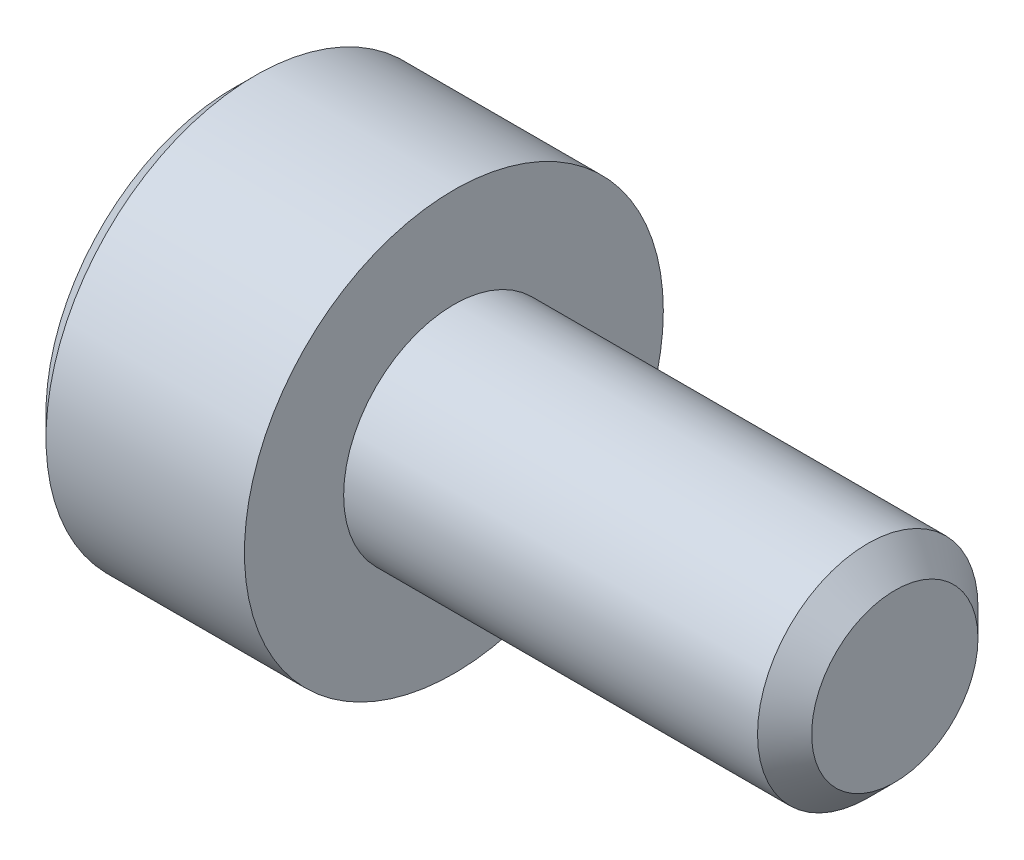
ISO-10303-21;
HEADER;
FILE_DESCRIPTION(('STEP AP214'),'2;1');
FILE_NAME('part.step','',(''),(''),'','','');
FILE_SCHEMA(('AUTOMOTIVE_DESIGN { 1 0 10303 214 1 1 1 1 }'));
ENDSEC;
DATA;
#1=APPLICATION_CONTEXT('core data for automotive mechanical design processes');
#2=APPLICATION_PROTOCOL_DEFINITION('international standard','automotive_design',2000,#1);
#3=PRODUCT_CONTEXT('',#1,'mechanical');
#4=PRODUCT('Part','Part','',(#3));
#5=PRODUCT_RELATED_PRODUCT_CATEGORY('part','',(#4));
#6=PRODUCT_DEFINITION_FORMATION('','',#4);
#7=PRODUCT_DEFINITION_CONTEXT('part definition',#1,'design');
#8=PRODUCT_DEFINITION('design','',#6,#7);
#9=PRODUCT_DEFINITION_SHAPE('','',#8);
#10=(LENGTH_UNIT() NAMED_UNIT(*) SI_UNIT(.MILLI.,.METRE.));
#11=(NAMED_UNIT(*) PLANE_ANGLE_UNIT() SI_UNIT($,.RADIAN.));
#12=(NAMED_UNIT(*) SI_UNIT($,.STERADIAN.) SOLID_ANGLE_UNIT());
#13=UNCERTAINTY_MEASURE_WITH_UNIT(LENGTH_MEASURE(1.E-05),#10,'distance_accuracy_value','');
#14=(GEOMETRIC_REPRESENTATION_CONTEXT(3) GLOBAL_UNCERTAINTY_ASSIGNED_CONTEXT((#13)) GLOBAL_UNIT_ASSIGNED_CONTEXT((#10,
#11,#12)) REPRESENTATION_CONTEXT('',''));
#15=CARTESIAN_POINT('',(0.,0.,0.));
#16=DIRECTION('',(0.,0.,1.));
#17=DIRECTION('',(1.,0.,0.));
#18=AXIS2_PLACEMENT_3D('',#15,#16,#17);
#19=CARTESIAN_POINT('',(-1.1,0.,0.));
#20=DIRECTION('',(1.,0.,0.));
#21=DIRECTION('',(0.,0.,-1.));
#22=AXIS2_PLACEMENT_3D('',#19,#20,#21);
#23=PLANE('',#22);
#24=CARTESIAN_POINT('',(-1.1,0.,0.));
#25=DIRECTION('',(-1.,0.,0.));
#26=DIRECTION('',(0.,-0.866025403784439,-0.5));
#27=AXIS2_PLACEMENT_3D('',#24,#25,#26);
#28=CIRCLE('',#27,0.75);
#29=CARTESIAN_POINT('',(-1.1,-0.649519052838329,-0.375));
#30=VERTEX_POINT('',#29);
#31=CARTESIAN_POINT('',(-1.1,-0.649519052838329,0.375));
#32=VERTEX_POINT('',#31);
#33=EDGE_CURVE('E113',#30,#32,#28,.T.);
#34=ORIENTED_EDGE('',*,*,#33,.F.);
#35=DIRECTION('',(0.,0.5,-0.866025403784438));
#36=VECTOR('',#35,1.);
#37=CARTESIAN_POINT('',(-1.1,-0.86602540378444,0.));
#38=LINE('',#37,#36);
#39=CARTESIAN_POINT('',(-1.1,-0.86602540378444,0.));
#40=VERTEX_POINT('',#39);
#41=EDGE_CURVE('E123',#40,#30,#38,.T.);
#42=ORIENTED_EDGE('',*,*,#41,.F.);
#43=DIRECTION('',(0.,-0.5,-0.866025403784438));
#44=VECTOR('',#43,1.);
#45=CARTESIAN_POINT('',(-1.1,-0.64951905283833,0.375));
#46=LINE('',#45,#44);
#47=EDGE_CURVE('E124',#32,#40,#46,.T.);
#48=ORIENTED_EDGE('',*,*,#47,.F.);
#49=EDGE_LOOP('',(#34,#42,#48));
#50=FACE_BOUND('',#49,.T.);
#51=ADVANCED_FACE('F17',(#50),#23,.F.);
#52=CARTESIAN_POINT('',(-1.1,0.,0.));
#53=DIRECTION('',(-1.,0.,0.));
#54=DIRECTION('',(0.,0.,1.));
#55=AXIS2_PLACEMENT_3D('',#52,#53,#54);
#56=CONICAL_SURFACE('',#55,0.75,1.0471975511966);
#57=CARTESIAN_POINT('',(-0.66698729810778,0.,0.));
#58=VERTEX_POINT('',#57);
#59=VERTEX_LOOP('',#58);
#60=FACE_BOUND('',#59,.T.);
#61=CARTESIAN_POINT('',(-1.1,0.,0.));
#62=DIRECTION('',(-1.,0.,0.));
#63=DIRECTION('',(0.,0.,1.));
#64=AXIS2_PLACEMENT_3D('',#61,#62,#63);
#65=CIRCLE('',#64,0.75);
#66=CARTESIAN_POINT('',(-1.1,0.,0.75));
#67=VERTEX_POINT('',#66);
#68=CARTESIAN_POINT('',(-1.1,0.649519052838329,0.375));
#69=VERTEX_POINT('',#68);
#70=EDGE_CURVE('E135',#67,#69,#65,.T.);
#71=ORIENTED_EDGE('',*,*,#70,.T.);
#72=CARTESIAN_POINT('',(-1.1,0.,0.));
#73=DIRECTION('',(-1.,0.,0.));
#74=DIRECTION('',(0.,0.866025403784438,0.5));
#75=AXIS2_PLACEMENT_3D('',#72,#73,#74);
#76=CIRCLE('',#75,0.75);
#77=CARTESIAN_POINT('',(-1.1,0.64951905283833,-0.375));
#78=VERTEX_POINT('',#77);
#79=EDGE_CURVE('E146',#69,#78,#76,.T.);
#80=ORIENTED_EDGE('',*,*,#79,.T.);
#81=CARTESIAN_POINT('',(-1.1,0.,0.));
#82=DIRECTION('',(-1.,0.,0.));
#83=DIRECTION('',(0.,0.866025403784439,-0.499999999999999));
#84=AXIS2_PLACEMENT_3D('',#81,#82,#83);
#85=CIRCLE('',#84,0.75);
#86=CARTESIAN_POINT('',(-1.1,0.,-0.75));
#87=VERTEX_POINT('',#86);
#88=EDGE_CURVE('E116',#78,#87,#85,.T.);
#89=ORIENTED_EDGE('',*,*,#88,.T.);
#90=CARTESIAN_POINT('',(-1.1,0.,0.));
#91=DIRECTION('',(-1.,0.,0.));
#92=DIRECTION('',(0.,0.,-1.));
#93=AXIS2_PLACEMENT_3D('',#90,#91,#92);
#94=CIRCLE('',#93,0.75);
#95=EDGE_CURVE('E97',#87,#30,#94,.T.);
#96=ORIENTED_EDGE('',*,*,#95,.T.);
#97=ORIENTED_EDGE('',*,*,#33,.T.);
#98=CARTESIAN_POINT('',(-1.1,0.,0.));
#99=DIRECTION('',(-1.,0.,0.));
#100=DIRECTION('',(0.,-0.866025403784439,0.5));
#101=AXIS2_PLACEMENT_3D('',#98,#99,#100);
#102=CIRCLE('',#101,0.75);
#103=EDGE_CURVE('E118',#32,#67,#102,.T.);
#104=ORIENTED_EDGE('',*,*,#103,.T.);
#105=EDGE_LOOP('',(#71,#80,#89,#96,#97,#104));
#106=FACE_BOUND('',#105,.T.);
#107=ADVANCED_FACE('F111',(#60,#106),#56,.F.);
#108=CARTESIAN_POINT('',(-1.1,-0.86602540378444,0.));
#109=DIRECTION('',(0.,0.866025403784439,0.5));
#110=DIRECTION('',(0.,-0.5,0.866025403784439));
#111=AXIS2_PLACEMENT_3D('',#108,#109,#110);
#112=PLANE('',#111);
#113=CARTESIAN_POINT('',(-1.9999999999179,-0.433012701974319,-0.749999999857802));
#114=CARTESIAN_POINT('',(-1.9401838107394,-0.49282889116983,-0.646395321056023));
#115=CARTESIAN_POINT('',(-1.8956946022904,-0.554952880204504,-0.538793415679117));
#116=CARTESIAN_POINT('',(-1.87906646576922,-0.669846193101474,-0.339792360291656));
#117=CARTESIAN_POINT('',(-1.89074693706411,-0.716350750813577,-0.259244103550774));
#118=CARTESIAN_POINT('',(-1.9377314223987,-0.798089755438794,-0.117667994579791));
#119=CARTESIAN_POINT('',(-1.96650341766561,-0.832528821447527,-0.0580177824874472));
#120=CARTESIAN_POINT('',(-1.99999999997828,-0.866025403762719,-3.76224996805638E-11));
#121=B_SPLINE_CURVE_WITH_KNOTS('',3,(#113,#114,#115,#116,#117,#118,#119,#120),.UNSPECIFIED.,.F.,
.F.,(4,2,2,4),(0.000254442834198881,0.395658519929771,0.67469393768709,0.894818657925145),.UNSPECIFIED.);
#122=CARTESIAN_POINT('',(-2.,-0.43301270189222,-0.75));
#123=VERTEX_POINT('',#122);
#124=CARTESIAN_POINT('',(-2.,-0.86602540378444,0.));
#125=VERTEX_POINT('',#124);
#126=EDGE_CURVE('E161',#123,#125,#121,.T.);
#127=ORIENTED_EDGE('',*,*,#126,.T.);
#128=DIRECTION('',(-1.,0.,0.));
#129=VECTOR('',#128,1.);
#130=CARTESIAN_POINT('',(-1.1,-0.86602540378444,0.));
#131=LINE('',#130,#129);
#132=EDGE_CURVE('E104',#40,#125,#131,.T.);
#133=ORIENTED_EDGE('',*,*,#132,.F.);
#134=ORIENTED_EDGE('',*,*,#41,.T.);
#135=DIRECTION('',(0.,0.5,-0.866025403784438));
#136=VECTOR('',#135,1.);
#137=CARTESIAN_POINT('',(-1.1,-0.64951905283833,-0.375000000000001));
#138=LINE('',#137,#136);
#139=CARTESIAN_POINT('',(-1.1,-0.43301270189222,-0.75));
#140=VERTEX_POINT('',#139);
#141=EDGE_CURVE('E94',#30,#140,#138,.T.);
#142=ORIENTED_EDGE('',*,*,#141,.T.);
#143=DIRECTION('',(-1.,0.,0.));
#144=VECTOR('',#143,1.);
#145=CARTESIAN_POINT('',(-1.1,-0.43301270189222,-0.75));
#146=LINE('',#145,#144);
#147=EDGE_CURVE('E103',#140,#123,#146,.T.);
#148=ORIENTED_EDGE('',*,*,#147,.T.);
#149=EDGE_LOOP('',(#127,#133,#134,#142,#148));
#150=FACE_BOUND('',#149,.T.);
#151=ADVANCED_FACE('F129',(#150),#112,.T.);
#152=CARTESIAN_POINT('',(-1.1,-0.43301270189222,0.75));
#153=DIRECTION('',(0.,0.866025403784439,-0.5));
#154=DIRECTION('',(0.,0.5,0.866025403784439));
#155=AXIS2_PLACEMENT_3D('',#152,#153,#154);
#156=PLANE('',#155);
#157=CARTESIAN_POINT('',(-1.9999999999179,-0.866025403702341,1.42198644352554E-10));
#158=CARTESIAN_POINT('',(-1.9401838107394,-0.806209214506829,0.103604678943978));
#159=CARTESIAN_POINT('',(-1.89569460229039,-0.744085225472155,0.211206584320885));
#160=CARTESIAN_POINT('',(-1.87906646576922,-0.629191912575185,0.410207639708346));
#161=CARTESIAN_POINT('',(-1.89074693706411,-0.582687354863082,0.490755896449228));
#162=CARTESIAN_POINT('',(-1.9377314223987,-0.500948350237865,0.63233200542021));
#163=CARTESIAN_POINT('',(-1.96650341766561,-0.466509284229132,0.691982217512554));
#164=CARTESIAN_POINT('',(-1.99999999997828,-0.433012701913941,0.749999999962378));
#165=B_SPLINE_CURVE_WITH_KNOTS('',3,(#157,#158,#159,#160,#161,#162,#163,#164),.UNSPECIFIED.,.F.,
.F.,(4,2,2,4),(0.000254442834198843,0.395658519929773,0.674693937687092,0.894818657925144),.UNSPECIFIED.);
#166=CARTESIAN_POINT('',(-2.,-0.43301270189222,0.75));
#167=VERTEX_POINT('',#166);
#168=EDGE_CURVE('E207',#125,#167,#165,.T.);
#169=ORIENTED_EDGE('',*,*,#168,.T.);
#170=DIRECTION('',(-1.,0.,0.));
#171=VECTOR('',#170,1.);
#172=CARTESIAN_POINT('',(-1.1,-0.43301270189222,0.75));
#173=LINE('',#172,#171);
#174=CARTESIAN_POINT('',(-1.1,-0.43301270189222,0.75));
#175=VERTEX_POINT('',#174);
#176=EDGE_CURVE('E197',#175,#167,#173,.T.);
#177=ORIENTED_EDGE('',*,*,#176,.F.);
#178=DIRECTION('',(0.,-0.5,-0.866025403784438));
#179=VECTOR('',#178,1.);
#180=CARTESIAN_POINT('',(-1.1,-0.43301270189222,0.75));
#181=LINE('',#180,#179);
#182=EDGE_CURVE('E206',#175,#32,#181,.T.);
#183=ORIENTED_EDGE('',*,*,#182,.T.);
#184=ORIENTED_EDGE('',*,*,#47,.T.);
#185=ORIENTED_EDGE('',*,*,#132,.T.);
#186=EDGE_LOOP('',(#169,#177,#183,#184,#185));
#187=FACE_BOUND('',#186,.T.);
#188=ADVANCED_FACE('F180',(#187),#156,.T.);
#189=ORIENTED_EDGE('',*,*,#70,.F.);
#190=DIRECTION('',(0.,-1.,0.));
#191=VECTOR('',#190,1.);
#192=CARTESIAN_POINT('',(-1.1,0.43301270189222,0.75));
#193=LINE('',#192,#191);
#194=CARTESIAN_POINT('',(-1.1,0.43301270189222,0.75));
#195=VERTEX_POINT('',#194);
#196=EDGE_CURVE('E213',#195,#67,#193,.T.);
#197=ORIENTED_EDGE('',*,*,#196,.F.);
#198=DIRECTION('',(0.,-0.5,0.866025403784438));
#199=VECTOR('',#198,1.);
#200=CARTESIAN_POINT('',(-1.1,0.64951905283833,0.375000000000001));
#201=LINE('',#200,#199);
#202=EDGE_CURVE('E218',#69,#195,#201,.T.);
#203=ORIENTED_EDGE('',*,*,#202,.F.);
#204=EDGE_LOOP('',(#189,#197,#203));
#205=FACE_BOUND('',#204,.T.);
#206=ADVANCED_FACE('F185',(#205),#23,.F.);
#207=ORIENTED_EDGE('',*,*,#79,.F.);
#208=DIRECTION('',(0.,-0.5,0.866025403784438));
#209=VECTOR('',#208,1.);
#210=CARTESIAN_POINT('',(-1.1,0.86602540378444,0.));
#211=LINE('',#210,#209);
#212=CARTESIAN_POINT('',(-1.1,0.86602540378444,0.));
#213=VERTEX_POINT('',#212);
#214=EDGE_CURVE('E223',#213,#69,#211,.T.);
#215=ORIENTED_EDGE('',*,*,#214,.F.);
#216=DIRECTION('',(0.,0.5,0.866025403784438));
#217=VECTOR('',#216,1.);
#218=CARTESIAN_POINT('',(-1.1,0.64951905283833,-0.375));
#219=LINE('',#218,#217);
#220=EDGE_CURVE('E228',#78,#213,#219,.T.);
#221=ORIENTED_EDGE('',*,*,#220,.F.);
#222=EDGE_LOOP('',(#207,#215,#221));
#223=FACE_BOUND('',#222,.T.);
#224=ADVANCED_FACE('F396',(#223),#23,.F.);
#225=ORIENTED_EDGE('',*,*,#88,.F.);
#226=DIRECTION('',(0.,0.5,0.866025403784439));
#227=VECTOR('',#226,1.);
#228=CARTESIAN_POINT('',(-1.1,0.43301270189222,-0.75));
#229=LINE('',#228,#227);
#230=CARTESIAN_POINT('',(-1.1,0.43301270189222,-0.75));
#231=VERTEX_POINT('',#230);
#232=EDGE_CURVE('E233',#231,#78,#229,.T.);
#233=ORIENTED_EDGE('',*,*,#232,.F.);
#234=DIRECTION('',(0.,1.,0.));
#235=VECTOR('',#234,1.);
#236=CARTESIAN_POINT('',(-1.1,0.,-0.75));
#237=LINE('',#236,#235);
#238=EDGE_CURVE('E238',#87,#231,#237,.T.);
#239=ORIENTED_EDGE('',*,*,#238,.F.);
#240=EDGE_LOOP('',(#225,#233,#239));
#241=FACE_BOUND('',#240,.T.);
#242=ADVANCED_FACE('F401',(#241),#23,.F.);
#243=ORIENTED_EDGE('',*,*,#95,.F.);
#244=DIRECTION('',(0.,1.,0.));
#245=VECTOR('',#244,1.);
#246=CARTESIAN_POINT('',(-1.1,-0.43301270189222,-0.75));
#247=LINE('',#246,#245);
#248=EDGE_CURVE('E98',#140,#87,#247,.T.);
#249=ORIENTED_EDGE('',*,*,#248,.F.);
#250=ORIENTED_EDGE('',*,*,#141,.F.);
#251=EDGE_LOOP('',(#243,#249,#250));
#252=FACE_BOUND('',#251,.T.);
#253=ADVANCED_FACE('F96',(#252),#23,.F.);
#254=ORIENTED_EDGE('',*,*,#103,.F.);
#255=ORIENTED_EDGE('',*,*,#182,.F.);
#256=DIRECTION('',(0.,-1.,0.));
#257=VECTOR('',#256,1.);
#258=CARTESIAN_POINT('',(-1.1,0.,0.75));
#259=LINE('',#258,#257);
#260=EDGE_CURVE('E248',#67,#175,#259,.T.);
#261=ORIENTED_EDGE('',*,*,#260,.F.);
#262=EDGE_LOOP('',(#254,#255,#261));
#263=FACE_BOUND('',#262,.T.);
#264=ADVANCED_FACE('F388',(#263),#23,.F.);
#265=CARTESIAN_POINT('',(-1.1339745962156,0.,0.));
#266=DIRECTION('',(-1.,0.,0.));
#267=DIRECTION('',(0.,0.,1.));
#268=AXIS2_PLACEMENT_3D('',#265,#266,#267);
#269=CONICAL_SURFACE('',#268,0.,0.785398163397472);
#270=ORIENTED_EDGE('',*,*,#126,.F.);
#271=CARTESIAN_POINT('',(-2.,0.,0.));
#272=DIRECTION('',(1.,0.,0.));
#273=DIRECTION('',(0.,-1.,0.));
#274=AXIS2_PLACEMENT_3D('',#271,#272,#273);
#275=CIRCLE('',#274,0.866025403784441);
#276=EDGE_CURVE('E253',#125,#123,#275,.T.);
#277=ORIENTED_EDGE('',*,*,#276,.F.);
#278=EDGE_LOOP('',(#270,#277));
#279=FACE_BOUND('',#278,.T.);
#280=ADVANCED_FACE('F187',(#279),#269,.F.);
#281=CARTESIAN_POINT('',(-1.1,-0.43301270189222,-0.75));
#282=DIRECTION('',(0.,0.,1.));
#283=DIRECTION('',(1.,0.,0.));
#284=AXIS2_PLACEMENT_3D('',#281,#282,#283);
#285=PLANE('',#284);
#286=CARTESIAN_POINT('',(-1.99999788888541,0.433008479647611,-0.75));
#287=CARTESIAN_POINT('',(-1.9634376860963,0.359887539323594,-0.75));
#288=CARTESIAN_POINT('',(-1.9325413183393,0.284716303607357,-0.75));
#289=CARTESIAN_POINT('',(-1.88870118310543,0.118731283464714,-0.75));
#290=CARTESIAN_POINT('',(-1.87925269831782,0.0304904917107161,-0.75));
#291=CARTESIAN_POINT('',(-1.89333255479817,-0.148514984328396,-0.75));
#292=CARTESIAN_POINT('',(-1.91601656828485,-0.234370493285572,-0.75));
#293=CARTESIAN_POINT('',(-1.96374813137855,-0.356858620157467,-0.75));
#294=CARTESIAN_POINT('',(-1.98109886940823,-0.395210421930607,-0.75));
#295=CARTESIAN_POINT('',(-1.99999985660165,-0.433012415095464,-0.75));
#296=B_SPLINE_CURVE_WITH_KNOTS('',3,(#286,#287,#288,#289,#290,#291,#292,#293,#294,#295),
.UNSPECIFIED.,.F.,.F.,(4,2,2,2,4),(1.55652675401323,1.8010941771872,2.06822950654005,
2.33439302759544,2.46112410524446),.UNSPECIFIED.);
#297=CARTESIAN_POINT('',(-2.,0.43301270189222,-0.75));
#298=VERTEX_POINT('',#297);
#299=EDGE_CURVE('E270',#298,#123,#296,.T.);
#300=ORIENTED_EDGE('',*,*,#299,.T.);
#301=ORIENTED_EDGE('',*,*,#147,.F.);
#302=ORIENTED_EDGE('',*,*,#248,.T.);
#303=ORIENTED_EDGE('',*,*,#238,.T.);
#304=DIRECTION('',(-1.,0.,0.));
#305=VECTOR('',#304,1.);
#306=CARTESIAN_POINT('',(-1.1,0.43301270189222,-0.75));
#307=LINE('',#306,#305);
#308=EDGE_CURVE('E281',#231,#298,#307,.T.);
#309=ORIENTED_EDGE('',*,*,#308,.T.);
#310=EDGE_LOOP('',(#300,#301,#302,#303,#309));
#311=FACE_BOUND('',#310,.T.);
#312=ADVANCED_FACE('F283',(#311),#285,.T.);
#313=ORIENTED_EDGE('',*,*,#168,.F.);
#314=CARTESIAN_POINT('',(-2.,0.,0.));
#315=DIRECTION('',(1.,0.,0.));
#316=DIRECTION('',(0.,-0.500000000000001,0.866025403784438));
#317=AXIS2_PLACEMENT_3D('',#314,#315,#316);
#318=CIRCLE('',#317,0.866025403784441);
#319=EDGE_CURVE('E415',#167,#125,#318,.T.);
#320=ORIENTED_EDGE('',*,*,#319,.F.);
#321=EDGE_LOOP('',(#313,#320));
#322=FACE_BOUND('',#321,.T.);
#323=ADVANCED_FACE('F292',(#322),#269,.F.);
#324=CARTESIAN_POINT('',(-1.1,0.43301270189222,0.75));
#325=DIRECTION('',(0.,0.,-1.));
#326=DIRECTION('',(-1.,0.,0.));
#327=AXIS2_PLACEMENT_3D('',#324,#325,#326);
#328=PLANE('',#327);
#329=CARTESIAN_POINT('',(-1.99999788888541,-0.433008479647612,0.75));
#330=CARTESIAN_POINT('',(-1.9634376860963,-0.359887539323595,0.75));
#331=CARTESIAN_POINT('',(-1.9325413183393,-0.284716303607357,0.75));
#332=CARTESIAN_POINT('',(-1.88870118310543,-0.118731283464714,0.75));
#333=CARTESIAN_POINT('',(-1.87925269831782,-0.030490491710716,0.75));
#334=CARTESIAN_POINT('',(-1.89333255479817,0.148514984328397,0.75));
#335=CARTESIAN_POINT('',(-1.91601656828485,0.234370493285572,0.75));
#336=CARTESIAN_POINT('',(-1.96374813137855,0.356858620157467,0.75));
#337=CARTESIAN_POINT('',(-1.98109886940823,0.395210421930606,0.75));
#338=CARTESIAN_POINT('',(-1.99999985660165,0.433012415095462,0.75));
#339=B_SPLINE_CURVE_WITH_KNOTS('',3,(#329,#330,#331,#332,#333,#334,#335,#336,#337,#338),
.UNSPECIFIED.,.F.,.F.,(4,2,2,2,4),(1.55652675401323,1.8010941771872,2.06822950654005,
2.33439302759544,2.46112410524446),.UNSPECIFIED.);
#340=CARTESIAN_POINT('',(-2.,0.43301270189222,0.75));
#341=VERTEX_POINT('',#340);
#342=EDGE_CURVE('E317',#167,#341,#339,.T.);
#343=ORIENTED_EDGE('',*,*,#342,.T.);
#344=DIRECTION('',(-1.,0.,0.));
#345=VECTOR('',#344,1.);
#346=CARTESIAN_POINT('',(-1.1,0.43301270189222,0.75));
#347=LINE('',#346,#345);
#348=EDGE_CURVE('E307',#195,#341,#347,.T.);
#349=ORIENTED_EDGE('',*,*,#348,.F.);
#350=ORIENTED_EDGE('',*,*,#196,.T.);
#351=ORIENTED_EDGE('',*,*,#260,.T.);
#352=ORIENTED_EDGE('',*,*,#176,.T.);
#353=EDGE_LOOP('',(#343,#349,#350,#351,#352));
#354=FACE_BOUND('',#353,.T.);
#355=ADVANCED_FACE('F293',(#354),#328,.T.);
#356=CARTESIAN_POINT('',(-1.1,0.86602540378444,0.));
#357=DIRECTION('',(0.,-0.866025403784439,-0.5));
#358=DIRECTION('',(0.,0.5,-0.866025403784439));
#359=AXIS2_PLACEMENT_3D('',#356,#357,#358);
#360=PLANE('',#359);
#361=CARTESIAN_POINT('',(-1.9999999999179,0.433012701974319,0.749999999857802));
#362=CARTESIAN_POINT('',(-1.9401838107394,0.49282889116983,0.646395321056023));
#363=CARTESIAN_POINT('',(-1.8956946022904,0.554952880204504,0.538793415679117));
#364=CARTESIAN_POINT('',(-1.87906646576922,0.669846193101474,0.339792360291656));
#365=CARTESIAN_POINT('',(-1.89074693706411,0.716350750813578,0.259244103550774));
#366=CARTESIAN_POINT('',(-1.9377314223987,0.798089755438794,0.117667994579791));
#367=CARTESIAN_POINT('',(-1.96650341766561,0.832528821447527,0.0580177824874475));
#368=CARTESIAN_POINT('',(-1.99999999997828,0.866025403762719,3.76229008780925E-11));
#369=B_SPLINE_CURVE_WITH_KNOTS('',3,(#361,#362,#363,#364,#365,#366,#367,#368),.UNSPECIFIED.,.F.,
.F.,(4,2,2,4),(0.000254442834198641,0.395658519929771,0.67469393768709,0.894818657925144),.UNSPECIFIED.);
#370=CARTESIAN_POINT('',(-2.,0.86602540378444,0.));
#371=VERTEX_POINT('',#370);
#372=EDGE_CURVE('E316',#341,#371,#369,.T.);
#373=ORIENTED_EDGE('',*,*,#372,.T.);
#374=DIRECTION('',(-1.,0.,0.));
#375=VECTOR('',#374,1.);
#376=CARTESIAN_POINT('',(-1.1,0.86602540378444,0.));
#377=LINE('',#376,#375);
#378=EDGE_CURVE('E327',#213,#371,#377,.T.);
#379=ORIENTED_EDGE('',*,*,#378,.F.);
#380=ORIENTED_EDGE('',*,*,#214,.T.);
#381=ORIENTED_EDGE('',*,*,#202,.T.);
#382=ORIENTED_EDGE('',*,*,#348,.T.);
#383=EDGE_LOOP('',(#373,#379,#380,#381,#382));
#384=FACE_BOUND('',#383,.T.);
#385=ADVANCED_FACE('F297',(#384),#360,.T.);
#386=CARTESIAN_POINT('',(-1.1,0.43301270189222,-0.75));
#387=DIRECTION('',(0.,-0.866025403784439,0.5));
#388=DIRECTION('',(0.,-0.5,-0.866025403784439));
#389=AXIS2_PLACEMENT_3D('',#386,#387,#388);
#390=PLANE('',#389);
#391=CARTESIAN_POINT('',(-1.9999999999179,0.866025403702341,-1.42198210671685E-10));
#392=CARTESIAN_POINT('',(-1.9401838107394,0.806209214506829,-0.103604678943977));
#393=CARTESIAN_POINT('',(-1.8956946022904,0.744085225472155,-0.211206584320884));
#394=CARTESIAN_POINT('',(-1.87906646576922,0.629191912575185,-0.410207639708346));
#395=CARTESIAN_POINT('',(-1.89074693706411,0.582687354863082,-0.490755896449228));
#396=CARTESIAN_POINT('',(-1.9377314223987,0.500948350237865,-0.63233200542021));
#397=CARTESIAN_POINT('',(-1.96650341766561,0.466509284229132,-0.691982217512554));
#398=CARTESIAN_POINT('',(-1.99999999997828,0.433012701913941,-0.749999999962378));
#399=B_SPLINE_CURVE_WITH_KNOTS('',3,(#391,#392,#393,#394,#395,#396,#397,#398),.UNSPECIFIED.,.F.,
.F.,(4,2,2,4),(0.000254442834198843,0.395658519929773,0.674693937687092,0.894818657925144),.UNSPECIFIED.);
#400=EDGE_CURVE('E335',#371,#298,#399,.T.);
#401=ORIENTED_EDGE('',*,*,#400,.T.);
#402=ORIENTED_EDGE('',*,*,#308,.F.);
#403=ORIENTED_EDGE('',*,*,#232,.T.);
#404=ORIENTED_EDGE('',*,*,#220,.T.);
#405=ORIENTED_EDGE('',*,*,#378,.T.);
#406=EDGE_LOOP('',(#401,#402,#403,#404,#405));
#407=FACE_BOUND('',#406,.T.);
#408=ADVANCED_FACE('F347',(#407),#390,.T.);
#409=CARTESIAN_POINT('',(-2.,0.86602540378444,0.));
#410=DIRECTION('',(1.,0.,0.));
#411=DIRECTION('',(0.,0.,-1.));
#412=AXIS2_PLACEMENT_3D('',#409,#410,#411);
#413=PLANE('',#412);
#414=CARTESIAN_POINT('',(-2.,0.,0.));
#415=DIRECTION('',(1.,0.,0.));
#416=DIRECTION('',(0.,0.,-1.));
#417=AXIS2_PLACEMENT_3D('',#414,#415,#416);
#418=CIRCLE('',#417,1.7);
#419=CARTESIAN_POINT('',(-2.,0.,-1.7));
#420=VERTEX_POINT('',#419);
#421=EDGE_CURVE('E345',#420,#420,#418,.T.);
#422=ORIENTED_EDGE('',*,*,#421,.F.);
#423=EDGE_LOOP('',(#422));
#424=FACE_BOUND('',#423,.T.);
#425=CARTESIAN_POINT('',(-2.,0.,0.));
#426=DIRECTION('',(1.,0.,0.));
#427=DIRECTION('',(0.,0.500000000000001,-0.866025403784438));
#428=AXIS2_PLACEMENT_3D('',#425,#426,#427);
#429=CIRCLE('',#428,0.866025403784441);
#430=EDGE_CURVE('E771',#298,#371,#429,.T.);
#431=ORIENTED_EDGE('',*,*,#430,.T.);
#432=CARTESIAN_POINT('',(-2.,0.,0.));
#433=DIRECTION('',(1.,0.,0.));
#434=DIRECTION('',(0.,1.,0.));
#435=AXIS2_PLACEMENT_3D('',#432,#433,#434);
#436=CIRCLE('',#435,0.866025403784441);
#437=EDGE_CURVE('E32',#371,#341,#436,.T.);
#438=ORIENTED_EDGE('',*,*,#437,.T.);
#439=CARTESIAN_POINT('',(-2.,0.,0.));
#440=DIRECTION('',(1.,0.,0.));
#441=DIRECTION('',(0.,0.5,0.866025403784438));
#442=AXIS2_PLACEMENT_3D('',#439,#440,#441);
#443=CIRCLE('',#442,0.866025403784441);
#444=EDGE_CURVE('E39',#341,#167,#443,.T.);
#445=ORIENTED_EDGE('',*,*,#444,.T.);
#446=ORIENTED_EDGE('',*,*,#319,.T.);
#447=ORIENTED_EDGE('',*,*,#276,.T.);
#448=CARTESIAN_POINT('',(-2.,0.,0.));
#449=DIRECTION('',(1.,0.,0.));
#450=DIRECTION('',(0.,-0.500000000000001,-0.866025403784438));
#451=AXIS2_PLACEMENT_3D('',#448,#449,#450);
#452=CIRCLE('',#451,0.866025403784441);
#453=EDGE_CURVE('E776',#123,#298,#452,.T.);
#454=ORIENTED_EDGE('',*,*,#453,.T.);
#455=EDGE_LOOP('',(#431,#438,#445,#446,#447,#454));
#456=FACE_BOUND('',#455,.T.);
#457=ADVANCED_FACE('F356',(#424,#456),#413,.F.);
#458=ORIENTED_EDGE('',*,*,#299,.F.);
#459=ORIENTED_EDGE('',*,*,#453,.F.);
#460=EDGE_LOOP('',(#458,#459));
#461=FACE_BOUND('',#460,.T.);
#462=ADVANCED_FACE('F359',(#461),#269,.F.);
#463=ORIENTED_EDGE('',*,*,#342,.F.);
#464=ORIENTED_EDGE('',*,*,#444,.F.);
#465=EDGE_LOOP('',(#463,#464));
#466=FACE_BOUND('',#465,.T.);
#467=ADVANCED_FACE('F493',(#466),#269,.F.);
#468=ORIENTED_EDGE('',*,*,#372,.F.);
#469=ORIENTED_EDGE('',*,*,#437,.F.);
#470=EDGE_LOOP('',(#468,#469));
#471=FACE_BOUND('',#470,.T.);
#472=ADVANCED_FACE('F500',(#471),#269,.F.);
#473=ORIENTED_EDGE('',*,*,#400,.F.);
#474=ORIENTED_EDGE('',*,*,#430,.F.);
#475=EDGE_LOOP('',(#473,#474));
#476=FACE_BOUND('',#475,.T.);
#477=ADVANCED_FACE('F365',(#476),#269,.F.);
#478=CARTESIAN_POINT('',(-2.,0.,0.));
#479=DIRECTION('',(1.,0.,0.));
#480=DIRECTION('',(0.,0.,-1.));
#481=AXIS2_PLACEMENT_3D('',#478,#479,#480);
#482=CONICAL_SURFACE('',#481,1.7,0.785398163397449);
#483=CARTESIAN_POINT('',(-1.8,0.,0.));
#484=DIRECTION('',(1.,0.,0.));
#485=DIRECTION('',(0.,0.,-1.));
#486=AXIS2_PLACEMENT_3D('',#483,#484,#485);
#487=CIRCLE('',#486,1.9);
#488=CARTESIAN_POINT('',(-1.8,0.,-1.9));
#489=VERTEX_POINT('',#488);
#490=EDGE_CURVE('E793',#489,#489,#487,.T.);
#491=ORIENTED_EDGE('',*,*,#490,.F.);
#492=EDGE_LOOP('',(#491));
#493=FACE_BOUND('',#492,.T.);
#494=ORIENTED_EDGE('',*,*,#421,.T.);
#495=EDGE_LOOP('',(#494));
#496=FACE_BOUND('',#495,.T.);
#497=ADVANCED_FACE('F361',(#493,#496),#482,.T.);
#498=CARTESIAN_POINT('',(4.,0.,0.));
#499=DIRECTION('',(1.,0.,0.));
#500=DIRECTION('',(0.,0.,-1.));
#501=AXIS2_PLACEMENT_3D('',#498,#499,#500);
#502=CYLINDRICAL_SURFACE('',#501,1.9);
#503=CARTESIAN_POINT('',(0.,0.,0.));
#504=DIRECTION('',(1.,0.,0.));
#505=DIRECTION('',(0.,0.,-1.));
#506=AXIS2_PLACEMENT_3D('',#503,#504,#505);
#507=CIRCLE('',#506,1.9);
#508=CARTESIAN_POINT('',(0.,0.,-1.9));
#509=VERTEX_POINT('',#508);
#510=EDGE_CURVE('E826',#509,#509,#507,.T.);
#511=ORIENTED_EDGE('',*,*,#510,.F.);
#512=EDGE_LOOP('',(#511));
#513=FACE_BOUND('',#512,.T.);
#514=ORIENTED_EDGE('',*,*,#490,.T.);
#515=EDGE_LOOP('',(#514));
#516=FACE_BOUND('',#515,.T.);
#517=ADVANCED_FACE('F364',(#513,#516),#502,.T.);
#518=CARTESIAN_POINT('',(0.,1.9,0.));
#519=DIRECTION('',(-1.,0.,0.));
#520=DIRECTION('',(0.,0.,1.));
#521=AXIS2_PLACEMENT_3D('',#518,#519,#520);
#522=PLANE('',#521);
#523=CARTESIAN_POINT('',(0.,0.,0.));
#524=DIRECTION('',(1.,0.,0.));
#525=DIRECTION('',(0.,0.,-1.));
#526=AXIS2_PLACEMENT_3D('',#523,#524,#525);
#527=CIRCLE('',#526,1.);
#528=CARTESIAN_POINT('',(0.,0.,-1.));
#529=VERTEX_POINT('',#528);
#530=EDGE_CURVE('E832',#529,#529,#527,.T.);
#531=ORIENTED_EDGE('',*,*,#530,.F.);
#532=EDGE_LOOP('',(#531));
#533=FACE_BOUND('',#532,.T.);
#534=ORIENTED_EDGE('',*,*,#510,.T.);
#535=EDGE_LOOP('',(#534));
#536=FACE_BOUND('',#535,.T.);
#537=ADVANCED_FACE('F369',(#533,#536),#522,.F.);
#538=CARTESIAN_POINT('',(4.,0.,0.));
#539=DIRECTION('',(1.,0.,0.));
#540=DIRECTION('',(0.,0.,-1.));
#541=AXIS2_PLACEMENT_3D('',#538,#539,#540);
#542=CYLINDRICAL_SURFACE('',#541,1.);
#543=CARTESIAN_POINT('',(3.7545,0.,0.));
#544=DIRECTION('',(1.,0.,0.));
#545=DIRECTION('',(0.,0.,-1.));
#546=AXIS2_PLACEMENT_3D('',#543,#544,#545);
#547=CIRCLE('',#546,1.);
#548=CARTESIAN_POINT('',(3.7545,0.,-1.));
#549=VERTEX_POINT('',#548);
#550=EDGE_CURVE('E26',#549,#549,#547,.T.);
#551=ORIENTED_EDGE('',*,*,#550,.F.);
#552=EDGE_LOOP('',(#551));
#553=FACE_BOUND('',#552,.T.);
#554=ORIENTED_EDGE('',*,*,#530,.T.);
#555=EDGE_LOOP('',(#554));
#556=FACE_BOUND('',#555,.T.);
#557=ADVANCED_FACE('F373',(#553,#556),#542,.T.);
#558=CARTESIAN_POINT('',(3.7545,0.,0.));
#559=DIRECTION('',(-1.,0.,0.));
#560=DIRECTION('',(0.,0.,1.));
#561=AXIS2_PLACEMENT_3D('',#558,#559,#560);
#562=CONICAL_SURFACE('',#561,1.,0.785398163397449);
#563=CARTESIAN_POINT('',(4.,0.,0.));
#564=DIRECTION('',(1.,0.,0.));
#565=DIRECTION('',(0.,0.,-1.));
#566=AXIS2_PLACEMENT_3D('',#563,#564,#565);
#567=CIRCLE('',#566,0.7545);
#568=CARTESIAN_POINT('',(4.,0.,-0.7545));
#569=VERTEX_POINT('',#568);
#570=EDGE_CURVE('E11',#569,#569,#567,.T.);
#571=ORIENTED_EDGE('',*,*,#570,.F.);
#572=EDGE_LOOP('',(#571));
#573=FACE_BOUND('',#572,.T.);
#574=ORIENTED_EDGE('',*,*,#550,.T.);
#575=EDGE_LOOP('',(#574));
#576=FACE_BOUND('',#575,.T.);
#577=ADVANCED_FACE('F376',(#573,#576),#562,.T.);
#578=CARTESIAN_POINT('',(4.,0.7545,0.));
#579=DIRECTION('',(-1.,0.,0.));
#580=DIRECTION('',(0.,0.,1.));
#581=AXIS2_PLACEMENT_3D('',#578,#579,#580);
#582=PLANE('',#581);
#583=ORIENTED_EDGE('',*,*,#570,.T.);
#584=EDGE_LOOP('',(#583));
#585=FACE_BOUND('',#584,.T.);
#586=ADVANCED_FACE('F19',(#585),#582,.F.);
#587=CLOSED_SHELL('',(#51,#107,#151,#188,#206,#224,#242,#253,#264,#280,#312,#323,#355,#385,#408,
#457,#462,#467,#472,#477,#497,#517,#537,#557,#577,#586));
#588=MANIFOLD_SOLID_BREP('B1',#587);
#589=ADVANCED_BREP_SHAPE_REPRESENTATION('',(#18,#588),#14);
#590=SHAPE_DEFINITION_REPRESENTATION(#9,#589);
ENDSEC;
END-ISO-10303-21;
